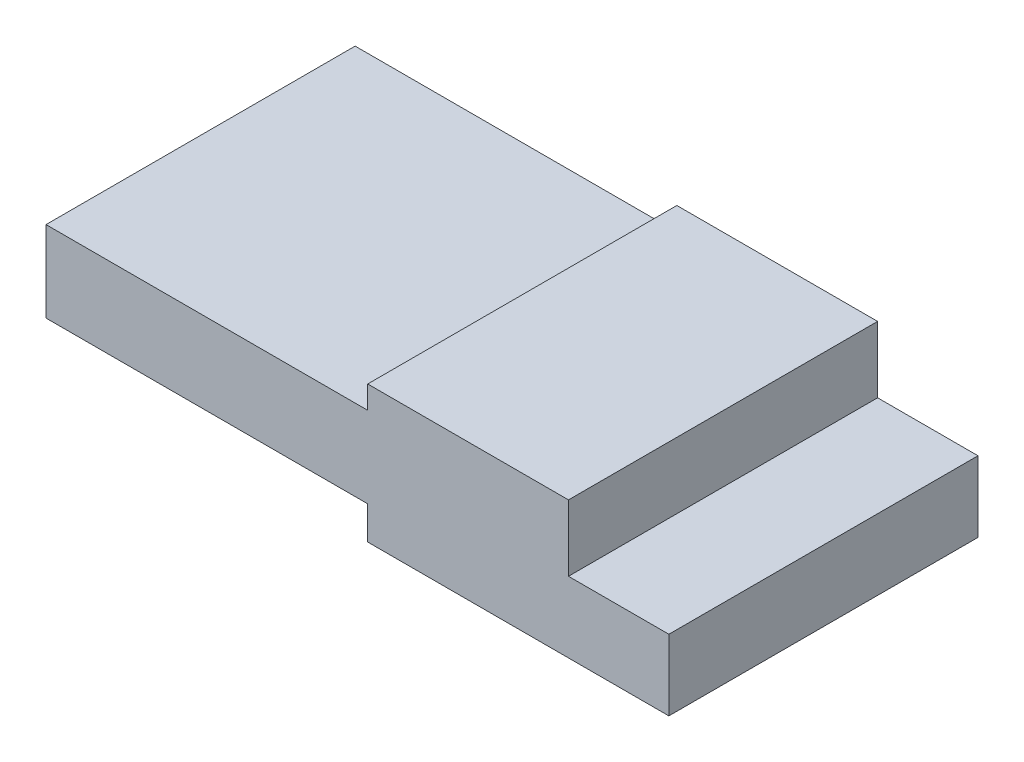
ISO-10303-21;
HEADER;
FILE_DESCRIPTION(('STEP AP214'),'2;1');
FILE_NAME('part.step','',(''),(''),'','','');
FILE_SCHEMA(('AUTOMOTIVE_DESIGN { 1 0 10303 214 1 1 1 1 }'));
ENDSEC;
DATA;
#1=APPLICATION_CONTEXT('core data for automotive mechanical design processes');
#2=APPLICATION_PROTOCOL_DEFINITION('international standard','automotive_design',2000,#1);
#3=PRODUCT_CONTEXT('',#1,'mechanical');
#4=PRODUCT('Part','Part','',(#3));
#5=PRODUCT_RELATED_PRODUCT_CATEGORY('part','',(#4));
#6=PRODUCT_DEFINITION_FORMATION('','',#4);
#7=PRODUCT_DEFINITION_CONTEXT('part definition',#1,'design');
#8=PRODUCT_DEFINITION('design','',#6,#7);
#9=PRODUCT_DEFINITION_SHAPE('','',#8);
#10=(LENGTH_UNIT() NAMED_UNIT(*) SI_UNIT(.MILLI.,.METRE.));
#11=(NAMED_UNIT(*) PLANE_ANGLE_UNIT() SI_UNIT($,.RADIAN.));
#12=(NAMED_UNIT(*) SI_UNIT($,.STERADIAN.) SOLID_ANGLE_UNIT());
#13=UNCERTAINTY_MEASURE_WITH_UNIT(LENGTH_MEASURE(1.E-05),#10,'distance_accuracy_value','');
#14=(GEOMETRIC_REPRESENTATION_CONTEXT(3) GLOBAL_UNCERTAINTY_ASSIGNED_CONTEXT((#13)) GLOBAL_UNIT_ASSIGNED_CONTEXT((#10,
#11,#12)) REPRESENTATION_CONTEXT('',''));
#15=CARTESIAN_POINT('',(0.,0.,0.));
#16=DIRECTION('',(0.,0.,1.));
#17=DIRECTION('',(1.,0.,0.));
#18=AXIS2_PLACEMENT_3D('',#15,#16,#17);
#19=CARTESIAN_POINT('',(7.1628,0.,6.8834));
#20=DIRECTION('',(0.,1.,0.));
#21=DIRECTION('',(-1.,0.,0.));
#22=AXIS2_PLACEMENT_3D('',#19,#20,#21);
#23=PLANE('',#22);
#24=DIRECTION('',(1.,0.,0.));
#25=VECTOR('',#24,1.);
#26=CARTESIAN_POINT('',(7.1628,0.,0.));
#27=LINE('',#26,#25);
#28=CARTESIAN_POINT('',(0.,0.,0.));
#29=VERTEX_POINT('',#28);
#30=CARTESIAN_POINT('',(7.1628,0.,0.));
#31=VERTEX_POINT('',#30);
#32=EDGE_CURVE('E141',#29,#31,#27,.T.);
#33=ORIENTED_EDGE('',*,*,#32,.T.);
#34=DIRECTION('',(0.,0.,-1.));
#35=VECTOR('',#34,1.);
#36=CARTESIAN_POINT('',(7.1628,0.,6.8834));
#37=LINE('',#36,#35);
#38=CARTESIAN_POINT('',(7.1628,0.,6.8834));
#39=VERTEX_POINT('',#38);
#40=EDGE_CURVE('E11',#39,#31,#37,.T.);
#41=ORIENTED_EDGE('',*,*,#40,.F.);
#42=DIRECTION('',(1.,0.,0.));
#43=VECTOR('',#42,1.);
#44=CARTESIAN_POINT('',(7.1628,0.,6.8834));
#45=LINE('',#44,#43);
#46=CARTESIAN_POINT('',(0.,0.,6.8834));
#47=VERTEX_POINT('',#46);
#48=EDGE_CURVE('E159',#47,#39,#45,.T.);
#49=ORIENTED_EDGE('',*,*,#48,.F.);
#50=DIRECTION('',(0.,0.,-1.));
#51=VECTOR('',#50,1.);
#52=CARTESIAN_POINT('',(0.,0.,6.8834));
#53=LINE('',#52,#51);
#54=EDGE_CURVE('E137',#47,#29,#53,.T.);
#55=ORIENTED_EDGE('',*,*,#54,.T.);
#56=EDGE_LOOP('',(#33,#41,#49,#55));
#57=FACE_BOUND('',#56,.T.);
#58=ADVANCED_FACE('F33',(#57),#23,.F.);
#59=CARTESIAN_POINT('',(7.1628,-0.736600000000001,6.8834));
#60=DIRECTION('',(1.,0.,0.));
#61=DIRECTION('',(0.,0.,-1.));
#62=AXIS2_PLACEMENT_3D('',#59,#60,#61);
#63=PLANE('',#62);
#64=DIRECTION('',(0.,-1.,0.));
#65=VECTOR('',#64,1.);
#66=CARTESIAN_POINT('',(7.1628,-0.736600000000001,0.));
#67=LINE('',#66,#65);
#68=CARTESIAN_POINT('',(7.1628,-0.736600000000001,0.));
#69=VERTEX_POINT('',#68);
#70=EDGE_CURVE('E144',#31,#69,#67,.T.);
#71=ORIENTED_EDGE('',*,*,#70,.T.);
#72=DIRECTION('',(0.,0.,-1.));
#73=VECTOR('',#72,1.);
#74=CARTESIAN_POINT('',(7.1628,-0.736600000000001,6.8834));
#75=LINE('',#74,#73);
#76=CARTESIAN_POINT('',(7.1628,-0.736600000000001,6.8834));
#77=VERTEX_POINT('',#76);
#78=EDGE_CURVE('E41',#77,#69,#75,.T.);
#79=ORIENTED_EDGE('',*,*,#78,.F.);
#80=DIRECTION('',(0.,-1.,0.));
#81=VECTOR('',#80,1.);
#82=CARTESIAN_POINT('',(7.1628,-0.736600000000001,6.8834));
#83=LINE('',#82,#81);
#84=EDGE_CURVE('E98',#39,#77,#83,.T.);
#85=ORIENTED_EDGE('',*,*,#84,.F.);
#86=ORIENTED_EDGE('',*,*,#40,.T.);
#87=EDGE_LOOP('',(#71,#79,#85,#86));
#88=FACE_BOUND('',#87,.T.);
#89=ADVANCED_FACE('F208',(#88),#63,.F.);
#90=CARTESIAN_POINT('',(13.8684,-0.7366,6.8834));
#91=DIRECTION('',(0.,1.,0.));
#92=DIRECTION('',(-1.,0.,0.));
#93=AXIS2_PLACEMENT_3D('',#90,#91,#92);
#94=PLANE('',#93);
#95=DIRECTION('',(1.,0.,0.));
#96=VECTOR('',#95,1.);
#97=CARTESIAN_POINT('',(13.8684,-0.7366,0.));
#98=LINE('',#97,#96);
#99=CARTESIAN_POINT('',(13.8684,-0.7366,0.));
#100=VERTEX_POINT('',#99);
#101=EDGE_CURVE('E146',#69,#100,#98,.T.);
#102=ORIENTED_EDGE('',*,*,#101,.T.);
#103=DIRECTION('',(0.,0.,-1.));
#104=VECTOR('',#103,1.);
#105=CARTESIAN_POINT('',(13.8684,-0.7366,6.8834));
#106=LINE('',#105,#104);
#107=CARTESIAN_POINT('',(13.8684,-0.7366,6.8834));
#108=VERTEX_POINT('',#107);
#109=EDGE_CURVE('E172',#108,#100,#106,.T.);
#110=ORIENTED_EDGE('',*,*,#109,.F.);
#111=DIRECTION('',(1.,0.,0.));
#112=VECTOR('',#111,1.);
#113=CARTESIAN_POINT('',(13.8684,-0.7366,6.8834));
#114=LINE('',#113,#112);
#115=EDGE_CURVE('E180',#77,#108,#114,.T.);
#116=ORIENTED_EDGE('',*,*,#115,.F.);
#117=ORIENTED_EDGE('',*,*,#78,.T.);
#118=EDGE_LOOP('',(#102,#110,#116,#117));
#119=FACE_BOUND('',#118,.T.);
#120=ADVANCED_FACE('F178',(#119),#94,.F.);
#121=CARTESIAN_POINT('',(13.8684,0.8382,6.8834));
#122=DIRECTION('',(-1.,0.,0.));
#123=DIRECTION('',(0.,0.,1.));
#124=AXIS2_PLACEMENT_3D('',#121,#122,#123);
#125=PLANE('',#124);
#126=DIRECTION('',(0.,1.,0.));
#127=VECTOR('',#126,1.);
#128=CARTESIAN_POINT('',(13.8684,0.8382,0.));
#129=LINE('',#128,#127);
#130=CARTESIAN_POINT('',(13.8684,0.8382,0.));
#131=VERTEX_POINT('',#130);
#132=EDGE_CURVE('E148',#100,#131,#129,.T.);
#133=ORIENTED_EDGE('',*,*,#132,.T.);
#134=DIRECTION('',(0.,0.,-1.));
#135=VECTOR('',#134,1.);
#136=CARTESIAN_POINT('',(13.8684,0.8382,6.8834));
#137=LINE('',#136,#135);
#138=CARTESIAN_POINT('',(13.8684,0.8382,6.8834));
#139=VERTEX_POINT('',#138);
#140=EDGE_CURVE('E169',#139,#131,#137,.T.);
#141=ORIENTED_EDGE('',*,*,#140,.F.);
#142=DIRECTION('',(0.,1.,0.));
#143=VECTOR('',#142,1.);
#144=CARTESIAN_POINT('',(13.8684,0.8382,6.8834));
#145=LINE('',#144,#143);
#146=EDGE_CURVE('E198',#108,#139,#145,.T.);
#147=ORIENTED_EDGE('',*,*,#146,.F.);
#148=ORIENTED_EDGE('',*,*,#109,.T.);
#149=EDGE_LOOP('',(#133,#141,#147,#148));
#150=FACE_BOUND('',#149,.T.);
#151=ADVANCED_FACE('F189',(#150),#125,.F.);
#152=CARTESIAN_POINT('',(11.6332,0.8382,6.8834));
#153=DIRECTION('',(0.,-1.,0.));
#154=DIRECTION('',(0.,0.,-1.));
#155=AXIS2_PLACEMENT_3D('',#152,#153,#154);
#156=PLANE('',#155);
#157=DIRECTION('',(-1.,0.,0.));
#158=VECTOR('',#157,1.);
#159=CARTESIAN_POINT('',(11.6332,0.8382,0.));
#160=LINE('',#159,#158);
#161=CARTESIAN_POINT('',(11.6332,0.8382,0.));
#162=VERTEX_POINT('',#161);
#163=EDGE_CURVE('E150',#131,#162,#160,.T.);
#164=ORIENTED_EDGE('',*,*,#163,.T.);
#165=DIRECTION('',(0.,0.,-1.));
#166=VECTOR('',#165,1.);
#167=CARTESIAN_POINT('',(11.6332,0.8382,6.8834));
#168=LINE('',#167,#166);
#169=CARTESIAN_POINT('',(11.6332,0.8382,6.8834));
#170=VERTEX_POINT('',#169);
#171=EDGE_CURVE('E166',#170,#162,#168,.T.);
#172=ORIENTED_EDGE('',*,*,#171,.F.);
#173=DIRECTION('',(-1.,0.,0.));
#174=VECTOR('',#173,1.);
#175=CARTESIAN_POINT('',(11.6332,0.8382,6.8834));
#176=LINE('',#175,#174);
#177=EDGE_CURVE('E195',#139,#170,#176,.T.);
#178=ORIENTED_EDGE('',*,*,#177,.F.);
#179=ORIENTED_EDGE('',*,*,#140,.T.);
#180=EDGE_LOOP('',(#164,#172,#178,#179));
#181=FACE_BOUND('',#180,.T.);
#182=ADVANCED_FACE('F193',(#181),#156,.F.);
#183=CARTESIAN_POINT('',(11.6332,2.3114,6.8834));
#184=DIRECTION('',(-1.,0.,0.));
#185=DIRECTION('',(0.,0.,1.));
#186=AXIS2_PLACEMENT_3D('',#183,#184,#185);
#187=PLANE('',#186);
#188=DIRECTION('',(0.,1.,0.));
#189=VECTOR('',#188,1.);
#190=CARTESIAN_POINT('',(11.6332,2.3114,0.));
#191=LINE('',#190,#189);
#192=CARTESIAN_POINT('',(11.6332,2.3114,0.));
#193=VERTEX_POINT('',#192);
#194=EDGE_CURVE('E152',#162,#193,#191,.T.);
#195=ORIENTED_EDGE('',*,*,#194,.T.);
#196=DIRECTION('',(0.,0.,-1.));
#197=VECTOR('',#196,1.);
#198=CARTESIAN_POINT('',(11.6332,2.3114,6.8834));
#199=LINE('',#198,#197);
#200=CARTESIAN_POINT('',(11.6332,2.3114,6.8834));
#201=VERTEX_POINT('',#200);
#202=EDGE_CURVE('E163',#201,#193,#199,.T.);
#203=ORIENTED_EDGE('',*,*,#202,.F.);
#204=DIRECTION('',(0.,1.,0.));
#205=VECTOR('',#204,1.);
#206=CARTESIAN_POINT('',(11.6332,2.3114,6.8834));
#207=LINE('',#206,#205);
#208=EDGE_CURVE('E197',#170,#201,#207,.T.);
#209=ORIENTED_EDGE('',*,*,#208,.F.);
#210=ORIENTED_EDGE('',*,*,#171,.T.);
#211=EDGE_LOOP('',(#195,#203,#209,#210));
#212=FACE_BOUND('',#211,.T.);
#213=ADVANCED_FACE('F220',(#212),#187,.F.);
#214=CARTESIAN_POINT('',(7.1628,2.3114,6.8834));
#215=DIRECTION('',(0.,-1.,0.));
#216=DIRECTION('',(0.,0.,-1.));
#217=AXIS2_PLACEMENT_3D('',#214,#215,#216);
#218=PLANE('',#217);
#219=DIRECTION('',(-1.,0.,0.));
#220=VECTOR('',#219,1.);
#221=CARTESIAN_POINT('',(7.1628,2.3114,0.));
#222=LINE('',#221,#220);
#223=CARTESIAN_POINT('',(7.1628,2.3114,0.));
#224=VERTEX_POINT('',#223);
#225=EDGE_CURVE('E154',#193,#224,#222,.T.);
#226=ORIENTED_EDGE('',*,*,#225,.T.);
#227=DIRECTION('',(0.,0.,-1.));
#228=VECTOR('',#227,1.);
#229=CARTESIAN_POINT('',(7.1628,2.3114,6.8834));
#230=LINE('',#229,#228);
#231=CARTESIAN_POINT('',(7.1628,2.3114,6.8834));
#232=VERTEX_POINT('',#231);
#233=EDGE_CURVE('E132',#232,#224,#230,.T.);
#234=ORIENTED_EDGE('',*,*,#233,.F.);
#235=DIRECTION('',(-1.,0.,0.));
#236=VECTOR('',#235,1.);
#237=CARTESIAN_POINT('',(7.1628,2.3114,6.8834));
#238=LINE('',#237,#236);
#239=EDGE_CURVE('E123',#201,#232,#238,.T.);
#240=ORIENTED_EDGE('',*,*,#239,.F.);
#241=ORIENTED_EDGE('',*,*,#202,.T.);
#242=EDGE_LOOP('',(#226,#234,#240,#241));
#243=FACE_BOUND('',#242,.T.);
#244=ADVANCED_FACE('F223',(#243),#218,.F.);
#245=CARTESIAN_POINT('',(7.1628,1.8034,6.8834));
#246=DIRECTION('',(1.,0.,0.));
#247=DIRECTION('',(0.,0.,-1.));
#248=AXIS2_PLACEMENT_3D('',#245,#246,#247);
#249=PLANE('',#248);
#250=DIRECTION('',(0.,-1.,0.));
#251=VECTOR('',#250,1.);
#252=CARTESIAN_POINT('',(7.1628,1.8034,0.));
#253=LINE('',#252,#251);
#254=CARTESIAN_POINT('',(7.1628,1.8034,0.));
#255=VERTEX_POINT('',#254);
#256=EDGE_CURVE('E131',#224,#255,#253,.T.);
#257=ORIENTED_EDGE('',*,*,#256,.T.);
#258=DIRECTION('',(0.,0.,-1.));
#259=VECTOR('',#258,1.);
#260=CARTESIAN_POINT('',(7.1628,1.8034,6.8834));
#261=LINE('',#260,#259);
#262=CARTESIAN_POINT('',(7.1628,1.8034,6.8834));
#263=VERTEX_POINT('',#262);
#264=EDGE_CURVE('E128',#263,#255,#261,.T.);
#265=ORIENTED_EDGE('',*,*,#264,.F.);
#266=DIRECTION('',(0.,-1.,0.));
#267=VECTOR('',#266,1.);
#268=CARTESIAN_POINT('',(7.1628,1.8034,6.8834));
#269=LINE('',#268,#267);
#270=EDGE_CURVE('E117',#232,#263,#269,.T.);
#271=ORIENTED_EDGE('',*,*,#270,.F.);
#272=ORIENTED_EDGE('',*,*,#233,.T.);
#273=EDGE_LOOP('',(#257,#265,#271,#272));
#274=FACE_BOUND('',#273,.T.);
#275=ADVANCED_FACE('F129',(#274),#249,.F.);
#276=CARTESIAN_POINT('',(0.,1.8034,6.8834));
#277=DIRECTION('',(0.,-1.,0.));
#278=DIRECTION('',(0.,0.,-1.));
#279=AXIS2_PLACEMENT_3D('',#276,#277,#278);
#280=PLANE('',#279);
#281=DIRECTION('',(-1.,0.,0.));
#282=VECTOR('',#281,1.);
#283=CARTESIAN_POINT('',(0.,1.8034,0.));
#284=LINE('',#283,#282);
#285=CARTESIAN_POINT('',(0.,1.8034,0.));
#286=VERTEX_POINT('',#285);
#287=EDGE_CURVE('E84',#255,#286,#284,.T.);
#288=ORIENTED_EDGE('',*,*,#287,.T.);
#289=DIRECTION('',(0.,0.,-1.));
#290=VECTOR('',#289,1.);
#291=CARTESIAN_POINT('',(0.,1.8034,6.8834));
#292=LINE('',#291,#290);
#293=CARTESIAN_POINT('',(0.,1.8034,6.8834));
#294=VERTEX_POINT('',#293);
#295=EDGE_CURVE('E133',#294,#286,#292,.T.);
#296=ORIENTED_EDGE('',*,*,#295,.F.);
#297=DIRECTION('',(-1.,0.,0.));
#298=VECTOR('',#297,1.);
#299=CARTESIAN_POINT('',(0.,1.8034,6.8834));
#300=LINE('',#299,#298);
#301=EDGE_CURVE('E121',#263,#294,#300,.T.);
#302=ORIENTED_EDGE('',*,*,#301,.F.);
#303=ORIENTED_EDGE('',*,*,#264,.T.);
#304=EDGE_LOOP('',(#288,#296,#302,#303));
#305=FACE_BOUND('',#304,.T.);
#306=ADVANCED_FACE('F135',(#305),#280,.F.);
#307=CARTESIAN_POINT('',(0.,0.,6.8834));
#308=DIRECTION('',(1.,0.,0.));
#309=DIRECTION('',(0.,0.,-1.));
#310=AXIS2_PLACEMENT_3D('',#307,#308,#309);
#311=PLANE('',#310);
#312=DIRECTION('',(0.,-1.,0.));
#313=VECTOR('',#312,1.);
#314=CARTESIAN_POINT('',(0.,0.,0.));
#315=LINE('',#314,#313);
#316=EDGE_CURVE('E90',#286,#29,#315,.T.);
#317=ORIENTED_EDGE('',*,*,#316,.T.);
#318=ORIENTED_EDGE('',*,*,#54,.F.);
#319=DIRECTION('',(0.,-1.,0.));
#320=VECTOR('',#319,1.);
#321=CARTESIAN_POINT('',(0.,0.,6.8834));
#322=LINE('',#321,#320);
#323=EDGE_CURVE('E49',#294,#47,#322,.T.);
#324=ORIENTED_EDGE('',*,*,#323,.F.);
#325=ORIENTED_EDGE('',*,*,#295,.T.);
#326=EDGE_LOOP('',(#317,#318,#324,#325));
#327=FACE_BOUND('',#326,.T.);
#328=ADVANCED_FACE('F232',(#327),#311,.F.);
#329=CARTESIAN_POINT('',(0.,0.,6.8834));
#330=DIRECTION('',(0.,0.,-1.));
#331=DIRECTION('',(-1.,0.,0.));
#332=AXIS2_PLACEMENT_3D('',#329,#330,#331);
#333=PLANE('',#332);
#334=ORIENTED_EDGE('',*,*,#48,.T.);
#335=ORIENTED_EDGE('',*,*,#84,.T.);
#336=ORIENTED_EDGE('',*,*,#115,.T.);
#337=ORIENTED_EDGE('',*,*,#146,.T.);
#338=ORIENTED_EDGE('',*,*,#177,.T.);
#339=ORIENTED_EDGE('',*,*,#208,.T.);
#340=ORIENTED_EDGE('',*,*,#239,.T.);
#341=ORIENTED_EDGE('',*,*,#270,.T.);
#342=ORIENTED_EDGE('',*,*,#301,.T.);
#343=ORIENTED_EDGE('',*,*,#323,.T.);
#344=EDGE_LOOP('',(#334,#335,#336,#337,#338,#339,#340,#341,#342,#343));
#345=FACE_BOUND('',#344,.T.);
#346=ADVANCED_FACE('F119',(#345),#333,.F.);
#347=CARTESIAN_POINT('',(0.,0.,0.));
#348=DIRECTION('',(0.,0.,-1.));
#349=DIRECTION('',(-1.,0.,0.));
#350=AXIS2_PLACEMENT_3D('',#347,#348,#349);
#351=PLANE('',#350);
#352=ORIENTED_EDGE('',*,*,#32,.F.);
#353=ORIENTED_EDGE('',*,*,#316,.F.);
#354=ORIENTED_EDGE('',*,*,#287,.F.);
#355=ORIENTED_EDGE('',*,*,#256,.F.);
#356=ORIENTED_EDGE('',*,*,#225,.F.);
#357=ORIENTED_EDGE('',*,*,#194,.F.);
#358=ORIENTED_EDGE('',*,*,#163,.F.);
#359=ORIENTED_EDGE('',*,*,#132,.F.);
#360=ORIENTED_EDGE('',*,*,#101,.F.);
#361=ORIENTED_EDGE('',*,*,#70,.F.);
#362=EDGE_LOOP('',(#352,#353,#354,#355,#356,#357,#358,#359,#360,#361));
#363=FACE_BOUND('',#362,.T.);
#364=ADVANCED_FACE('F184',(#363),#351,.T.);
#365=CLOSED_SHELL('',(#58,#89,#120,#151,#182,#213,#244,#275,#306,#328,#346,#364));
#366=MANIFOLD_SOLID_BREP('B2',#365);
#367=ADVANCED_BREP_SHAPE_REPRESENTATION('',(#18,#366),#14);
#368=SHAPE_DEFINITION_REPRESENTATION(#9,#367);
ENDSEC;
END-ISO-10303-21;
